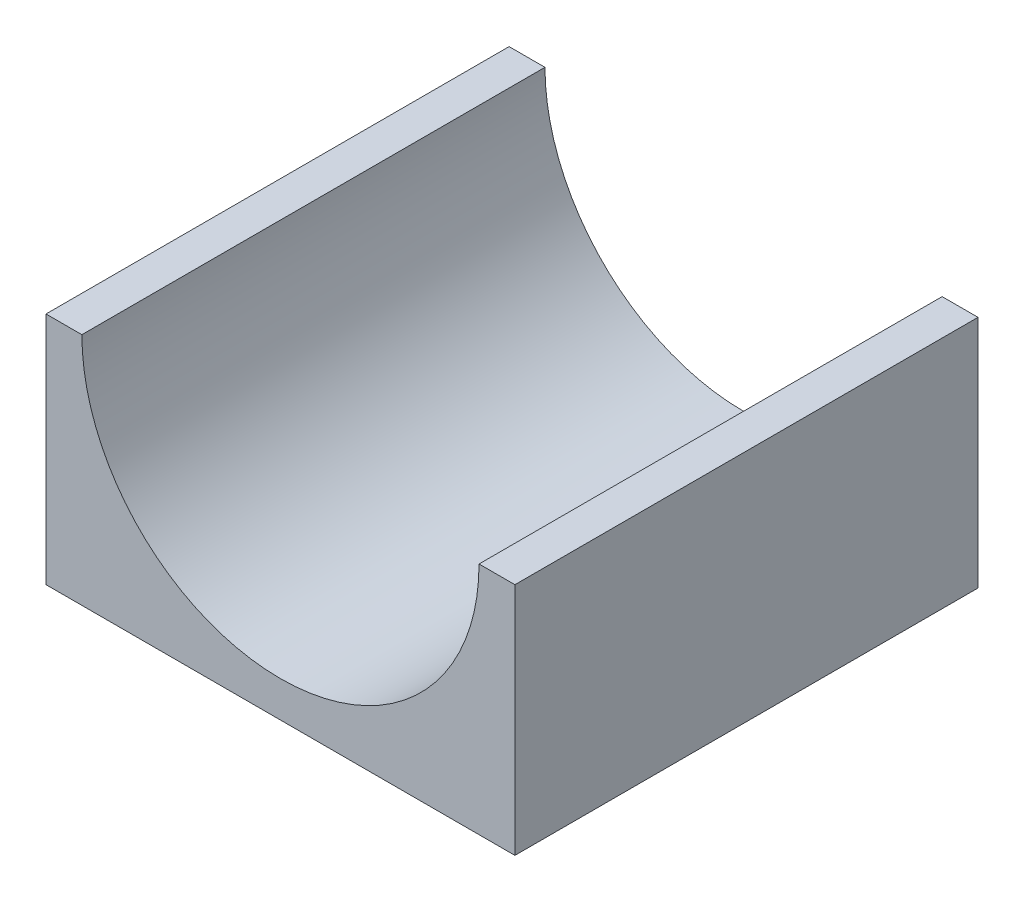
ISO-10303-21;
HEADER;
FILE_DESCRIPTION(('STEP AP214'),'2;1');
FILE_NAME('part.step','',(''),(''),'','','');
FILE_SCHEMA(('AUTOMOTIVE_DESIGN { 1 0 10303 214 1 1 1 1 }'));
ENDSEC;
DATA;
#1=APPLICATION_CONTEXT('core data for automotive mechanical design processes');
#2=APPLICATION_PROTOCOL_DEFINITION('international standard','automotive_design',2000,#1);
#3=PRODUCT_CONTEXT('',#1,'mechanical');
#4=PRODUCT('Part','Part','',(#3));
#5=PRODUCT_RELATED_PRODUCT_CATEGORY('part','',(#4));
#6=PRODUCT_DEFINITION_FORMATION('','',#4);
#7=PRODUCT_DEFINITION_CONTEXT('part definition',#1,'design');
#8=PRODUCT_DEFINITION('design','',#6,#7);
#9=PRODUCT_DEFINITION_SHAPE('','',#8);
#10=(LENGTH_UNIT() NAMED_UNIT(*) SI_UNIT(.MILLI.,.METRE.));
#11=(NAMED_UNIT(*) PLANE_ANGLE_UNIT() SI_UNIT($,.RADIAN.));
#12=(NAMED_UNIT(*) SI_UNIT($,.STERADIAN.) SOLID_ANGLE_UNIT());
#13=UNCERTAINTY_MEASURE_WITH_UNIT(LENGTH_MEASURE(1.E-05),#10,'distance_accuracy_value','');
#14=(GEOMETRIC_REPRESENTATION_CONTEXT(3) GLOBAL_UNCERTAINTY_ASSIGNED_CONTEXT((#13)) GLOBAL_UNIT_ASSIGNED_CONTEXT((#10,
#11,#12)) REPRESENTATION_CONTEXT('',''));
#15=CARTESIAN_POINT('',(0.,0.,0.));
#16=DIRECTION('',(0.,0.,1.));
#17=DIRECTION('',(1.,0.,0.));
#18=AXIS2_PLACEMENT_3D('',#15,#16,#17);
#19=CARTESIAN_POINT('',(130.74,0.,129.12));
#20=DIRECTION('',(0.,1.,0.));
#21=DIRECTION('',(-1.,0.,0.));
#22=AXIS2_PLACEMENT_3D('',#19,#20,#21);
#23=PLANE('',#22);
#24=DIRECTION('',(1.,0.,0.));
#25=VECTOR('',#24,1.);
#26=CARTESIAN_POINT('',(130.74,0.,0.));
#27=LINE('',#26,#25);
#28=CARTESIAN_POINT('',(0.,0.,0.));
#29=VERTEX_POINT('',#28);
#30=CARTESIAN_POINT('',(130.74,0.,0.));
#31=VERTEX_POINT('',#30);
#32=EDGE_CURVE('E128',#29,#31,#27,.T.);
#33=ORIENTED_EDGE('',*,*,#32,.T.);
#34=DIRECTION('',(0.,0.,-1.));
#35=VECTOR('',#34,1.);
#36=CARTESIAN_POINT('',(130.74,0.,129.12));
#37=LINE('',#36,#35);
#38=CARTESIAN_POINT('',(130.74,0.,129.12));
#39=VERTEX_POINT('',#38);
#40=EDGE_CURVE('E11',#39,#31,#37,.T.);
#41=ORIENTED_EDGE('',*,*,#40,.F.);
#42=DIRECTION('',(1.,0.,0.));
#43=VECTOR('',#42,1.);
#44=CARTESIAN_POINT('',(130.74,0.,129.12));
#45=LINE('',#44,#43);
#46=CARTESIAN_POINT('',(0.,0.,129.12));
#47=VERTEX_POINT('',#46);
#48=EDGE_CURVE('E144',#47,#39,#45,.T.);
#49=ORIENTED_EDGE('',*,*,#48,.F.);
#50=DIRECTION('',(0.,0.,-1.));
#51=VECTOR('',#50,1.);
#52=CARTESIAN_POINT('',(0.,0.,129.12));
#53=LINE('',#52,#51);
#54=EDGE_CURVE('E124',#47,#29,#53,.T.);
#55=ORIENTED_EDGE('',*,*,#54,.T.);
#56=EDGE_LOOP('',(#33,#41,#49,#55));
#57=FACE_BOUND('',#56,.T.);
#58=ADVANCED_FACE('F39',(#57),#23,.F.);
#59=CARTESIAN_POINT('',(130.74,65.3700000000001,129.12));
#60=DIRECTION('',(-1.,0.,0.));
#61=DIRECTION('',(0.,-1.,0.));
#62=AXIS2_PLACEMENT_3D('',#59,#60,#61);
#63=PLANE('',#62);
#64=DIRECTION('',(0.,1.,0.));
#65=VECTOR('',#64,1.);
#66=CARTESIAN_POINT('',(130.74,65.3700000000001,0.));
#67=LINE('',#66,#65);
#68=CARTESIAN_POINT('',(130.74,65.3700000000001,0.));
#69=VERTEX_POINT('',#68);
#70=EDGE_CURVE('E132',#31,#69,#67,.T.);
#71=ORIENTED_EDGE('',*,*,#70,.T.);
#72=DIRECTION('',(0.,0.,-1.));
#73=VECTOR('',#72,1.);
#74=CARTESIAN_POINT('',(130.74,65.3700000000001,129.12));
#75=LINE('',#74,#73);
#76=CARTESIAN_POINT('',(130.74,65.3700000000001,129.12));
#77=VERTEX_POINT('',#76);
#78=EDGE_CURVE('E48',#77,#69,#75,.T.);
#79=ORIENTED_EDGE('',*,*,#78,.F.);
#80=DIRECTION('',(0.,1.,0.));
#81=VECTOR('',#80,1.);
#82=CARTESIAN_POINT('',(130.74,65.3700000000001,129.12));
#83=LINE('',#82,#81);
#84=EDGE_CURVE('E93',#39,#77,#83,.T.);
#85=ORIENTED_EDGE('',*,*,#84,.F.);
#86=ORIENTED_EDGE('',*,*,#40,.T.);
#87=EDGE_LOOP('',(#71,#79,#85,#86));
#88=FACE_BOUND('',#87,.T.);
#89=ADVANCED_FACE('F172',(#88),#63,.F.);
#90=CARTESIAN_POINT('',(120.74,65.37,129.12));
#91=DIRECTION('',(0.,-1.,0.));
#92=DIRECTION('',(1.,0.,0.));
#93=AXIS2_PLACEMENT_3D('',#90,#91,#92);
#94=PLANE('',#93);
#95=DIRECTION('',(-1.,0.,0.));
#96=VECTOR('',#95,1.);
#97=CARTESIAN_POINT('',(120.74,65.37,0.));
#98=LINE('',#97,#96);
#99=CARTESIAN_POINT('',(120.74,65.37,0.));
#100=VERTEX_POINT('',#99);
#101=EDGE_CURVE('E135',#69,#100,#98,.T.);
#102=ORIENTED_EDGE('',*,*,#101,.T.);
#103=DIRECTION('',(0.,0.,-1.));
#104=VECTOR('',#103,1.);
#105=CARTESIAN_POINT('',(120.74,65.37,129.12));
#106=LINE('',#105,#104);
#107=CARTESIAN_POINT('',(120.74,65.37,129.12));
#108=VERTEX_POINT('',#107);
#109=EDGE_CURVE('E117',#108,#100,#106,.T.);
#110=ORIENTED_EDGE('',*,*,#109,.F.);
#111=DIRECTION('',(-1.,0.,0.));
#112=VECTOR('',#111,1.);
#113=CARTESIAN_POINT('',(120.74,65.37,129.12));
#114=LINE('',#113,#112);
#115=EDGE_CURVE('E106',#77,#108,#114,.T.);
#116=ORIENTED_EDGE('',*,*,#115,.F.);
#117=ORIENTED_EDGE('',*,*,#78,.T.);
#118=EDGE_LOOP('',(#102,#110,#116,#117));
#119=FACE_BOUND('',#118,.T.);
#120=ADVANCED_FACE('F154',(#119),#94,.F.);
#121=CARTESIAN_POINT('',(65.37,65.37,129.12));
#122=DIRECTION('',(0.,0.,-1.));
#123=DIRECTION('',(-1.,0.,0.));
#124=AXIS2_PLACEMENT_3D('',#121,#122,#123);
#125=CYLINDRICAL_SURFACE('',#124,55.37);
#126=CARTESIAN_POINT('',(65.37,65.37,0.));
#127=DIRECTION('',(0.,0.,-1.));
#128=DIRECTION('',(1.,0.,0.));
#129=AXIS2_PLACEMENT_3D('',#126,#127,#128);
#130=CIRCLE('',#129,55.37);
#131=CARTESIAN_POINT('',(9.99999999999999,65.37,0.));
#132=VERTEX_POINT('',#131);
#133=EDGE_CURVE('E115',#100,#132,#130,.T.);
#134=ORIENTED_EDGE('',*,*,#133,.T.);
#135=DIRECTION('',(0.,0.,-1.));
#136=VECTOR('',#135,1.);
#137=CARTESIAN_POINT('',(9.99999999999999,65.37,129.12));
#138=LINE('',#137,#136);
#139=CARTESIAN_POINT('',(9.99999999999999,65.37,129.12));
#140=VERTEX_POINT('',#139);
#141=EDGE_CURVE('E112',#140,#132,#138,.T.);
#142=ORIENTED_EDGE('',*,*,#141,.F.);
#143=CARTESIAN_POINT('',(65.37,65.37,129.12));
#144=DIRECTION('',(0.,0.,-1.));
#145=DIRECTION('',(1.,0.,0.));
#146=AXIS2_PLACEMENT_3D('',#143,#144,#145);
#147=CIRCLE('',#146,55.37);
#148=EDGE_CURVE('E100',#108,#140,#147,.T.);
#149=ORIENTED_EDGE('',*,*,#148,.F.);
#150=ORIENTED_EDGE('',*,*,#109,.T.);
#151=EDGE_LOOP('',(#134,#142,#149,#150));
#152=FACE_BOUND('',#151,.T.);
#153=ADVANCED_FACE('F113',(#152),#125,.F.);
#154=CARTESIAN_POINT('',(0.,65.37,129.12));
#155=DIRECTION('',(0.,-1.,0.));
#156=DIRECTION('',(1.,0.,0.));
#157=AXIS2_PLACEMENT_3D('',#154,#155,#156);
#158=PLANE('',#157);
#159=DIRECTION('',(-1.,0.,0.));
#160=VECTOR('',#159,1.);
#161=CARTESIAN_POINT('',(0.,65.37,0.));
#162=LINE('',#161,#160);
#163=CARTESIAN_POINT('',(0.,65.37,0.));
#164=VERTEX_POINT('',#163);
#165=EDGE_CURVE('E79',#132,#164,#162,.T.);
#166=ORIENTED_EDGE('',*,*,#165,.T.);
#167=DIRECTION('',(0.,0.,-1.));
#168=VECTOR('',#167,1.);
#169=CARTESIAN_POINT('',(0.,65.37,129.12));
#170=LINE('',#169,#168);
#171=CARTESIAN_POINT('',(0.,65.37,129.12));
#172=VERTEX_POINT('',#171);
#173=EDGE_CURVE('E118',#172,#164,#170,.T.);
#174=ORIENTED_EDGE('',*,*,#173,.F.);
#175=DIRECTION('',(-1.,0.,0.));
#176=VECTOR('',#175,1.);
#177=CARTESIAN_POINT('',(0.,65.37,129.12));
#178=LINE('',#177,#176);
#179=EDGE_CURVE('E104',#140,#172,#178,.T.);
#180=ORIENTED_EDGE('',*,*,#179,.F.);
#181=ORIENTED_EDGE('',*,*,#141,.T.);
#182=EDGE_LOOP('',(#166,#174,#180,#181));
#183=FACE_BOUND('',#182,.T.);
#184=ADVANCED_FACE('F120',(#183),#158,.F.);
#185=CARTESIAN_POINT('',(0.,0.,129.12));
#186=DIRECTION('',(1.,0.,0.));
#187=DIRECTION('',(0.,0.,-1.));
#188=AXIS2_PLACEMENT_3D('',#185,#186,#187);
#189=PLANE('',#188);
#190=DIRECTION('',(0.,-1.,0.));
#191=VECTOR('',#190,1.);
#192=CARTESIAN_POINT('',(0.,0.,0.));
#193=LINE('',#192,#191);
#194=EDGE_CURVE('E85',#164,#29,#193,.T.);
#195=ORIENTED_EDGE('',*,*,#194,.T.);
#196=ORIENTED_EDGE('',*,*,#54,.F.);
#197=DIRECTION('',(0.,-1.,0.));
#198=VECTOR('',#197,1.);
#199=CARTESIAN_POINT('',(0.,0.,129.12));
#200=LINE('',#199,#198);
#201=EDGE_CURVE('E56',#172,#47,#200,.T.);
#202=ORIENTED_EDGE('',*,*,#201,.F.);
#203=ORIENTED_EDGE('',*,*,#173,.T.);
#204=EDGE_LOOP('',(#195,#196,#202,#203));
#205=FACE_BOUND('',#204,.T.);
#206=ADVANCED_FACE('F161',(#205),#189,.F.);
#207=CARTESIAN_POINT('',(65.37,65.37,129.12));
#208=DIRECTION('',(0.,0.,1.));
#209=DIRECTION('',(1.,0.,0.));
#210=AXIS2_PLACEMENT_3D('',#207,#208,#209);
#211=PLANE('',#210);
#212=ORIENTED_EDGE('',*,*,#48,.T.);
#213=ORIENTED_EDGE('',*,*,#84,.T.);
#214=ORIENTED_EDGE('',*,*,#115,.T.);
#215=ORIENTED_EDGE('',*,*,#148,.T.);
#216=ORIENTED_EDGE('',*,*,#179,.T.);
#217=ORIENTED_EDGE('',*,*,#201,.T.);
#218=EDGE_LOOP('',(#212,#213,#214,#215,#216,#217));
#219=FACE_BOUND('',#218,.T.);
#220=ADVANCED_FACE('F102',(#219),#211,.T.);
#221=CARTESIAN_POINT('',(65.37,65.37,0.));
#222=DIRECTION('',(0.,0.,1.));
#223=DIRECTION('',(1.,0.,0.));
#224=AXIS2_PLACEMENT_3D('',#221,#222,#223);
#225=PLANE('',#224);
#226=ORIENTED_EDGE('',*,*,#32,.F.);
#227=ORIENTED_EDGE('',*,*,#194,.F.);
#228=ORIENTED_EDGE('',*,*,#165,.F.);
#229=ORIENTED_EDGE('',*,*,#133,.F.);
#230=ORIENTED_EDGE('',*,*,#101,.F.);
#231=ORIENTED_EDGE('',*,*,#70,.F.);
#232=EDGE_LOOP('',(#226,#227,#228,#229,#230,#231));
#233=FACE_BOUND('',#232,.T.);
#234=ADVANCED_FACE('F157',(#233),#225,.F.);
#235=CLOSED_SHELL('',(#58,#89,#120,#153,#184,#206,#220,#234));
#236=MANIFOLD_SOLID_BREP('B2',#235);
#237=ADVANCED_BREP_SHAPE_REPRESENTATION('',(#18,#236),#14);
#238=SHAPE_DEFINITION_REPRESENTATION(#9,#237);
ENDSEC;
END-ISO-10303-21;
